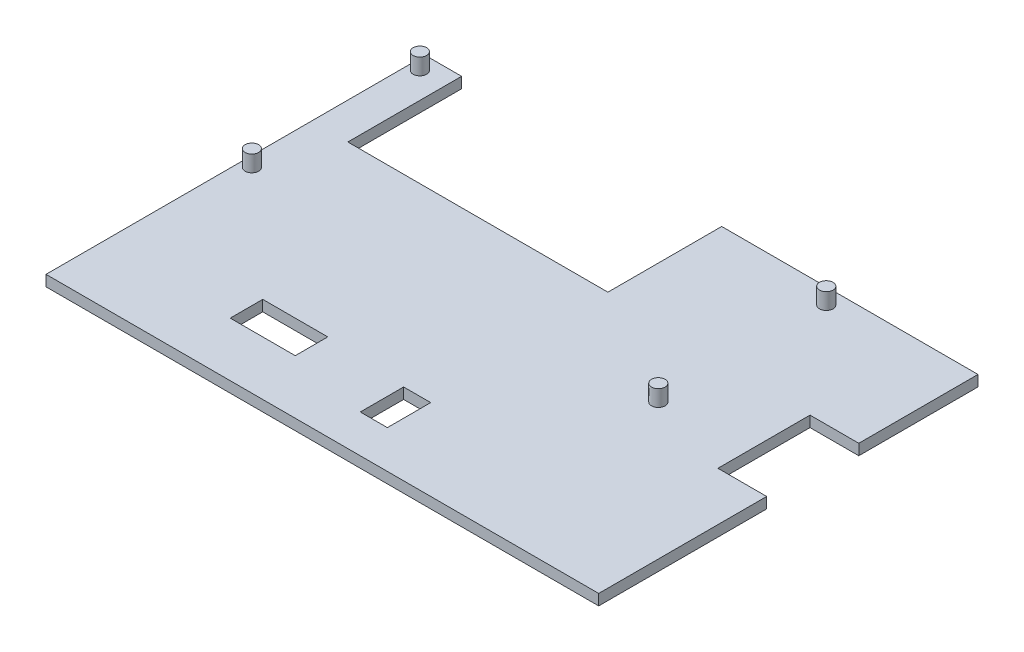
ISO-10303-21;
HEADER;
FILE_DESCRIPTION(('STEP AP214'),'2;1');
FILE_NAME('part.step','',(''),(''),'','','');
FILE_SCHEMA(('AUTOMOTIVE_DESIGN { 1 0 10303 214 1 1 1 1 }'));
ENDSEC;
DATA;
#1=APPLICATION_CONTEXT('core data for automotive mechanical design processes');
#2=APPLICATION_PROTOCOL_DEFINITION('international standard','automotive_design',2000,#1);
#3=PRODUCT_CONTEXT('',#1,'mechanical');
#4=PRODUCT('Part','Part','',(#3));
#5=PRODUCT_RELATED_PRODUCT_CATEGORY('part','',(#4));
#6=PRODUCT_DEFINITION_FORMATION('','',#4);
#7=PRODUCT_DEFINITION_CONTEXT('part definition',#1,'design');
#8=PRODUCT_DEFINITION('design','',#6,#7);
#9=PRODUCT_DEFINITION_SHAPE('','',#8);
#10=(LENGTH_UNIT() NAMED_UNIT(*) SI_UNIT(.MILLI.,.METRE.));
#11=(NAMED_UNIT(*) PLANE_ANGLE_UNIT() SI_UNIT($,.RADIAN.));
#12=(NAMED_UNIT(*) SI_UNIT($,.STERADIAN.) SOLID_ANGLE_UNIT());
#13=UNCERTAINTY_MEASURE_WITH_UNIT(LENGTH_MEASURE(1.E-05),#10,'distance_accuracy_value','');
#14=(GEOMETRIC_REPRESENTATION_CONTEXT(3) GLOBAL_UNCERTAINTY_ASSIGNED_CONTEXT((#13)) GLOBAL_UNIT_ASSIGNED_CONTEXT((#10,
#11,#12)) REPRESENTATION_CONTEXT('',''));
#15=CARTESIAN_POINT('',(0.,0.,0.));
#16=DIRECTION('',(0.,0.,1.));
#17=DIRECTION('',(1.,0.,0.));
#18=AXIS2_PLACEMENT_3D('',#15,#16,#17);
#19=CARTESIAN_POINT('',(0.,2.,0.));
#20=DIRECTION('',(0.,-1.,0.));
#21=DIRECTION('',(0.,0.,-1.));
#22=AXIS2_PLACEMENT_3D('',#19,#20,#21);
#23=PLANE('',#22);
#24=CARTESIAN_POINT('',(76.9,2.,-36.1));
#25=DIRECTION('',(0.,-1.,0.));
#26=DIRECTION('',(0.,0.,-1.));
#27=AXIS2_PLACEMENT_3D('',#24,#25,#26);
#28=CIRCLE('',#27,1.25);
#29=CARTESIAN_POINT('',(76.9,2.,-37.35));
#30=VERTEX_POINT('',#29);
#31=EDGE_CURVE('E41',#30,#30,#28,.F.);
#32=ORIENTED_EDGE('',*,*,#31,.F.);
#33=EDGE_LOOP('',(#32));
#34=FACE_BOUND('',#33,.T.);
#35=CARTESIAN_POINT('',(1.9,2.,-67.1));
#36=DIRECTION('',(0.,-1.,0.));
#37=DIRECTION('',(0.,0.,-1.));
#38=AXIS2_PLACEMENT_3D('',#35,#36,#37);
#39=CIRCLE('',#38,1.25);
#40=CARTESIAN_POINT('',(1.9,2.,-68.35));
#41=VERTEX_POINT('',#40);
#42=EDGE_CURVE('E325',#41,#41,#39,.F.);
#43=ORIENTED_EDGE('',*,*,#42,.F.);
#44=EDGE_LOOP('',(#43));
#45=FACE_BOUND('',#44,.T.);
#46=DIRECTION('',(0.,0.,1.));
#47=VECTOR('',#46,1.);
#48=CARTESIAN_POINT('',(24.,2.,-16.));
#49=LINE('',#48,#47);
#50=CARTESIAN_POINT('',(24.,2.,-16.));
#51=VERTEX_POINT('',#50);
#52=CARTESIAN_POINT('',(24.,2.,-10.));
#53=VERTEX_POINT('',#52);
#54=EDGE_CURVE('E209',#51,#53,#49,.T.);
#55=ORIENTED_EDGE('',*,*,#54,.F.);
#56=DIRECTION('',(-1.,0.,0.));
#57=VECTOR('',#56,1.);
#58=CARTESIAN_POINT('',(24.,2.,-16.));
#59=LINE('',#58,#57);
#60=CARTESIAN_POINT('',(36.,2.,-16.));
#61=VERTEX_POINT('',#60);
#62=EDGE_CURVE('E217',#61,#51,#59,.T.);
#63=ORIENTED_EDGE('',*,*,#62,.F.);
#64=DIRECTION('',(0.,0.,-1.));
#65=VECTOR('',#64,1.);
#66=CARTESIAN_POINT('',(36.,2.,-16.));
#67=LINE('',#66,#65);
#68=CARTESIAN_POINT('',(36.,2.,-10.));
#69=VERTEX_POINT('',#68);
#70=EDGE_CURVE('E214',#69,#61,#67,.T.);
#71=ORIENTED_EDGE('',*,*,#70,.F.);
#72=DIRECTION('',(1.,0.,0.));
#73=VECTOR('',#72,1.);
#74=CARTESIAN_POINT('',(24.,2.,-10.));
#75=LINE('',#74,#73);
#76=EDGE_CURVE('E211',#53,#69,#75,.T.);
#77=ORIENTED_EDGE('',*,*,#76,.F.);
#78=EDGE_LOOP('',(#55,#63,#71,#77));
#79=FACE_BOUND('',#78,.T.);
#80=DIRECTION('',(0.,0.,1.));
#81=VECTOR('',#80,1.);
#82=CARTESIAN_POINT('',(0.,2.,0.));
#83=LINE('',#82,#81);
#84=CARTESIAN_POINT('',(0.,2.,-70.));
#85=VERTEX_POINT('',#84);
#86=CARTESIAN_POINT('',(0.,2.,0.));
#87=VERTEX_POINT('',#86);
#88=EDGE_CURVE('E240',#85,#87,#83,.T.);
#89=ORIENTED_EDGE('',*,*,#88,.T.);
#90=DIRECTION('',(1.,0.,0.));
#91=VECTOR('',#90,1.);
#92=CARTESIAN_POINT('',(0.,2.,0.));
#93=LINE('',#92,#91);
#94=CARTESIAN_POINT('',(102.,2.,0.));
#95=VERTEX_POINT('',#94);
#96=EDGE_CURVE('E243',#87,#95,#93,.T.);
#97=ORIENTED_EDGE('',*,*,#96,.T.);
#98=DIRECTION('',(0.,0.,-1.));
#99=VECTOR('',#98,1.);
#100=CARTESIAN_POINT('',(102.,2.,-31.));
#101=LINE('',#100,#99);
#102=CARTESIAN_POINT('',(102.,2.,-31.));
#103=VERTEX_POINT('',#102);
#104=EDGE_CURVE('E246',#95,#103,#101,.T.);
#105=ORIENTED_EDGE('',*,*,#104,.T.);
#106=DIRECTION('',(-1.,0.,0.));
#107=VECTOR('',#106,1.);
#108=CARTESIAN_POINT('',(93.,2.,-31.));
#109=LINE('',#108,#107);
#110=CARTESIAN_POINT('',(93.,2.,-31.));
#111=VERTEX_POINT('',#110);
#112=EDGE_CURVE('E248',#103,#111,#109,.T.);
#113=ORIENTED_EDGE('',*,*,#112,.T.);
#114=DIRECTION('',(0.,0.,-1.));
#115=VECTOR('',#114,1.);
#116=CARTESIAN_POINT('',(93.,2.,-48.));
#117=LINE('',#116,#115);
#118=CARTESIAN_POINT('',(93.,2.,-48.));
#119=VERTEX_POINT('',#118);
#120=EDGE_CURVE('E250',#111,#119,#117,.T.);
#121=ORIENTED_EDGE('',*,*,#120,.T.);
#122=DIRECTION('',(1.,0.,0.));
#123=VECTOR('',#122,1.);
#124=CARTESIAN_POINT('',(102.,2.,-48.));
#125=LINE('',#124,#123);
#126=CARTESIAN_POINT('',(102.,2.,-48.));
#127=VERTEX_POINT('',#126);
#128=EDGE_CURVE('E252',#119,#127,#125,.T.);
#129=ORIENTED_EDGE('',*,*,#128,.T.);
#130=DIRECTION('',(0.,0.,-1.));
#131=VECTOR('',#130,1.);
#132=CARTESIAN_POINT('',(102.,2.,-70.));
#133=LINE('',#132,#131);
#134=CARTESIAN_POINT('',(102.,2.,-70.));
#135=VERTEX_POINT('',#134);
#136=EDGE_CURVE('E254',#127,#135,#133,.T.);
#137=ORIENTED_EDGE('',*,*,#136,.T.);
#138=DIRECTION('',(-1.,0.,0.));
#139=VECTOR('',#138,1.);
#140=CARTESIAN_POINT('',(54.7,2.,-70.));
#141=LINE('',#140,#139);
#142=CARTESIAN_POINT('',(54.7,2.,-70.));
#143=VERTEX_POINT('',#142);
#144=EDGE_CURVE('E256',#135,#143,#141,.T.);
#145=ORIENTED_EDGE('',*,*,#144,.T.);
#146=DIRECTION('',(0.,0.,1.));
#147=VECTOR('',#146,1.);
#148=CARTESIAN_POINT('',(54.7,2.,-49.));
#149=LINE('',#148,#147);
#150=CARTESIAN_POINT('',(54.7,2.,-49.));
#151=VERTEX_POINT('',#150);
#152=EDGE_CURVE('E258',#143,#151,#149,.T.);
#153=ORIENTED_EDGE('',*,*,#152,.T.);
#154=DIRECTION('',(-1.,0.,0.));
#155=VECTOR('',#154,1.);
#156=CARTESIAN_POINT('',(6.7,2.,-49.));
#157=LINE('',#156,#155);
#158=CARTESIAN_POINT('',(6.7,2.,-49.));
#159=VERTEX_POINT('',#158);
#160=EDGE_CURVE('E260',#151,#159,#157,.T.);
#161=ORIENTED_EDGE('',*,*,#160,.T.);
#162=DIRECTION('',(0.,0.,-1.));
#163=VECTOR('',#162,1.);
#164=CARTESIAN_POINT('',(6.7,2.,-70.));
#165=LINE('',#164,#163);
#166=CARTESIAN_POINT('',(6.7,2.,-70.));
#167=VERTEX_POINT('',#166);
#168=EDGE_CURVE('E262',#159,#167,#165,.T.);
#169=ORIENTED_EDGE('',*,*,#168,.T.);
#170=DIRECTION('',(-1.,0.,0.));
#171=VECTOR('',#170,1.);
#172=CARTESIAN_POINT('',(0.,2.,-70.));
#173=LINE('',#172,#171);
#174=EDGE_CURVE('E264',#167,#85,#173,.T.);
#175=ORIENTED_EDGE('',*,*,#174,.T.);
#176=EDGE_LOOP('',(#89,#97,#105,#113,#121,#129,#137,#145,#153,#161,#169,#175));
#177=FACE_BOUND('',#176,.T.);
#178=DIRECTION('',(0.,0.,1.));
#179=VECTOR('',#178,1.);
#180=CARTESIAN_POINT('',(51.,2.,-15.));
#181=LINE('',#180,#179);
#182=CARTESIAN_POINT('',(51.,2.,-15.));
#183=VERTEX_POINT('',#182);
#184=CARTESIAN_POINT('',(51.,2.,-7.));
#185=VERTEX_POINT('',#184);
#186=EDGE_CURVE('E170',#183,#185,#181,.T.);
#187=ORIENTED_EDGE('',*,*,#186,.F.);
#188=DIRECTION('',(-1.,0.,0.));
#189=VECTOR('',#188,1.);
#190=CARTESIAN_POINT('',(51.,2.,-15.));
#191=LINE('',#190,#189);
#192=CARTESIAN_POINT('',(56.,2.,-15.));
#193=VERTEX_POINT('',#192);
#194=EDGE_CURVE('E193',#193,#183,#191,.T.);
#195=ORIENTED_EDGE('',*,*,#194,.F.);
#196=DIRECTION('',(0.,0.,-1.));
#197=VECTOR('',#196,1.);
#198=CARTESIAN_POINT('',(56.,2.,-15.));
#199=LINE('',#198,#197);
#200=CARTESIAN_POINT('',(56.,2.,-7.));
#201=VERTEX_POINT('',#200);
#202=EDGE_CURVE('E191',#201,#193,#199,.T.);
#203=ORIENTED_EDGE('',*,*,#202,.F.);
#204=DIRECTION('',(1.,0.,0.));
#205=VECTOR('',#204,1.);
#206=CARTESIAN_POINT('',(51.,2.,-7.));
#207=LINE('',#206,#205);
#208=EDGE_CURVE('E178',#185,#201,#207,.T.);
#209=ORIENTED_EDGE('',*,*,#208,.F.);
#210=EDGE_LOOP('',(#187,#195,#203,#209));
#211=FACE_BOUND('',#210,.T.);
#212=CARTESIAN_POINT('',(1.9,2.,-36.1));
#213=DIRECTION('',(0.,-1.,0.));
#214=DIRECTION('',(0.,0.,-1.));
#215=AXIS2_PLACEMENT_3D('',#212,#213,#214);
#216=CIRCLE('',#215,1.25);
#217=CARTESIAN_POINT('',(1.9,2.,-37.35));
#218=VERTEX_POINT('',#217);
#219=EDGE_CURVE('E328',#218,#218,#216,.F.);
#220=ORIENTED_EDGE('',*,*,#219,.F.);
#221=EDGE_LOOP('',(#220));
#222=FACE_BOUND('',#221,.T.);
#223=CARTESIAN_POINT('',(76.9,2.,-67.1));
#224=DIRECTION('',(0.,-1.,0.));
#225=DIRECTION('',(0.,0.,-1.));
#226=AXIS2_PLACEMENT_3D('',#223,#224,#225);
#227=CIRCLE('',#226,1.25);
#228=CARTESIAN_POINT('',(76.9,2.,-68.35));
#229=VERTEX_POINT('',#228);
#230=EDGE_CURVE('E11',#229,#229,#227,.F.);
#231=ORIENTED_EDGE('',*,*,#230,.F.);
#232=EDGE_LOOP('',(#231));
#233=FACE_BOUND('',#232,.T.);
#234=ADVANCED_FACE('F33',(#34,#45,#79,#177,#211,#222,#233),#23,.F.);
#235=CARTESIAN_POINT('',(0.,0.,0.));
#236=DIRECTION('',(0.,-1.,0.));
#237=DIRECTION('',(0.,0.,-1.));
#238=AXIS2_PLACEMENT_3D('',#235,#236,#237);
#239=PLANE('',#238);
#240=DIRECTION('',(-1.,0.,0.));
#241=VECTOR('',#240,1.);
#242=CARTESIAN_POINT('',(24.,0.,-16.));
#243=LINE('',#242,#241);
#244=CARTESIAN_POINT('',(36.,0.,-16.));
#245=VERTEX_POINT('',#244);
#246=CARTESIAN_POINT('',(24.,0.,-16.));
#247=VERTEX_POINT('',#246);
#248=EDGE_CURVE('E212',#245,#247,#243,.T.);
#249=ORIENTED_EDGE('',*,*,#248,.T.);
#250=DIRECTION('',(0.,0.,1.));
#251=VECTOR('',#250,1.);
#252=CARTESIAN_POINT('',(24.,0.,-16.));
#253=LINE('',#252,#251);
#254=CARTESIAN_POINT('',(24.,0.,-10.));
#255=VERTEX_POINT('',#254);
#256=EDGE_CURVE('E186',#247,#255,#253,.T.);
#257=ORIENTED_EDGE('',*,*,#256,.T.);
#258=DIRECTION('',(1.,0.,0.));
#259=VECTOR('',#258,1.);
#260=CARTESIAN_POINT('',(24.,0.,-10.));
#261=LINE('',#260,#259);
#262=CARTESIAN_POINT('',(36.,0.,-10.));
#263=VERTEX_POINT('',#262);
#264=EDGE_CURVE('E222',#255,#263,#261,.T.);
#265=ORIENTED_EDGE('',*,*,#264,.T.);
#266=DIRECTION('',(0.,0.,-1.));
#267=VECTOR('',#266,1.);
#268=CARTESIAN_POINT('',(36.,0.,-16.));
#269=LINE('',#268,#267);
#270=EDGE_CURVE('E225',#263,#245,#269,.T.);
#271=ORIENTED_EDGE('',*,*,#270,.T.);
#272=EDGE_LOOP('',(#249,#257,#265,#271));
#273=FACE_BOUND('',#272,.T.);
#274=DIRECTION('',(0.,0.,1.));
#275=VECTOR('',#274,1.);
#276=CARTESIAN_POINT('',(0.,0.,0.));
#277=LINE('',#276,#275);
#278=CARTESIAN_POINT('',(0.,0.,-70.));
#279=VERTEX_POINT('',#278);
#280=CARTESIAN_POINT('',(0.,0.,0.));
#281=VERTEX_POINT('',#280);
#282=EDGE_CURVE('E239',#279,#281,#277,.T.);
#283=ORIENTED_EDGE('',*,*,#282,.F.);
#284=DIRECTION('',(-1.,0.,0.));
#285=VECTOR('',#284,1.);
#286=CARTESIAN_POINT('',(0.,0.,-70.));
#287=LINE('',#286,#285);
#288=CARTESIAN_POINT('',(6.7,0.,-70.));
#289=VERTEX_POINT('',#288);
#290=EDGE_CURVE('E244',#289,#279,#287,.T.);
#291=ORIENTED_EDGE('',*,*,#290,.F.);
#292=DIRECTION('',(0.,0.,-1.));
#293=VECTOR('',#292,1.);
#294=CARTESIAN_POINT('',(6.7,0.,-70.));
#295=LINE('',#294,#293);
#296=CARTESIAN_POINT('',(6.7,0.,-49.));
#297=VERTEX_POINT('',#296);
#298=EDGE_CURVE('E287',#297,#289,#295,.T.);
#299=ORIENTED_EDGE('',*,*,#298,.F.);
#300=DIRECTION('',(-1.,0.,0.));
#301=VECTOR('',#300,1.);
#302=CARTESIAN_POINT('',(6.7,0.,-49.));
#303=LINE('',#302,#301);
#304=CARTESIAN_POINT('',(54.7,0.,-49.));
#305=VERTEX_POINT('',#304);
#306=EDGE_CURVE('E285',#305,#297,#303,.T.);
#307=ORIENTED_EDGE('',*,*,#306,.F.);
#308=DIRECTION('',(0.,0.,1.));
#309=VECTOR('',#308,1.);
#310=CARTESIAN_POINT('',(54.7,0.,-49.));
#311=LINE('',#310,#309);
#312=CARTESIAN_POINT('',(54.7,0.,-70.));
#313=VERTEX_POINT('',#312);
#314=EDGE_CURVE('E283',#313,#305,#311,.T.);
#315=ORIENTED_EDGE('',*,*,#314,.F.);
#316=DIRECTION('',(-1.,0.,0.));
#317=VECTOR('',#316,1.);
#318=CARTESIAN_POINT('',(54.7,0.,-70.));
#319=LINE('',#318,#317);
#320=CARTESIAN_POINT('',(102.,0.,-70.));
#321=VERTEX_POINT('',#320);
#322=EDGE_CURVE('E281',#321,#313,#319,.T.);
#323=ORIENTED_EDGE('',*,*,#322,.F.);
#324=DIRECTION('',(0.,0.,-1.));
#325=VECTOR('',#324,1.);
#326=CARTESIAN_POINT('',(102.,0.,-70.));
#327=LINE('',#326,#325);
#328=CARTESIAN_POINT('',(102.,0.,-48.));
#329=VERTEX_POINT('',#328);
#330=EDGE_CURVE('E279',#329,#321,#327,.T.);
#331=ORIENTED_EDGE('',*,*,#330,.F.);
#332=DIRECTION('',(1.,0.,0.));
#333=VECTOR('',#332,1.);
#334=CARTESIAN_POINT('',(102.,0.,-48.));
#335=LINE('',#334,#333);
#336=CARTESIAN_POINT('',(93.,0.,-48.));
#337=VERTEX_POINT('',#336);
#338=EDGE_CURVE('E277',#337,#329,#335,.T.);
#339=ORIENTED_EDGE('',*,*,#338,.F.);
#340=DIRECTION('',(0.,0.,-1.));
#341=VECTOR('',#340,1.);
#342=CARTESIAN_POINT('',(93.,0.,-48.));
#343=LINE('',#342,#341);
#344=CARTESIAN_POINT('',(93.,0.,-31.));
#345=VERTEX_POINT('',#344);
#346=EDGE_CURVE('E275',#345,#337,#343,.T.);
#347=ORIENTED_EDGE('',*,*,#346,.F.);
#348=DIRECTION('',(-1.,0.,0.));
#349=VECTOR('',#348,1.);
#350=CARTESIAN_POINT('',(93.,0.,-31.));
#351=LINE('',#350,#349);
#352=CARTESIAN_POINT('',(102.,0.,-31.));
#353=VERTEX_POINT('',#352);
#354=EDGE_CURVE('E273',#353,#345,#351,.T.);
#355=ORIENTED_EDGE('',*,*,#354,.F.);
#356=DIRECTION('',(0.,0.,-1.));
#357=VECTOR('',#356,1.);
#358=CARTESIAN_POINT('',(102.,0.,-31.));
#359=LINE('',#358,#357);
#360=CARTESIAN_POINT('',(102.,0.,0.));
#361=VERTEX_POINT('',#360);
#362=EDGE_CURVE('E271',#361,#353,#359,.T.);
#363=ORIENTED_EDGE('',*,*,#362,.F.);
#364=DIRECTION('',(1.,0.,0.));
#365=VECTOR('',#364,1.);
#366=CARTESIAN_POINT('',(0.,0.,0.));
#367=LINE('',#366,#365);
#368=EDGE_CURVE('E269',#281,#361,#367,.T.);
#369=ORIENTED_EDGE('',*,*,#368,.F.);
#370=EDGE_LOOP('',(#283,#291,#299,#307,#315,#323,#331,#339,#347,#355,#363,#369));
#371=FACE_BOUND('',#370,.T.);
#372=DIRECTION('',(-1.,0.,0.));
#373=VECTOR('',#372,1.);
#374=CARTESIAN_POINT('',(51.,0.,-15.));
#375=LINE('',#374,#373);
#376=CARTESIAN_POINT('',(56.,0.,-15.));
#377=VERTEX_POINT('',#376);
#378=CARTESIAN_POINT('',(51.,0.,-15.));
#379=VERTEX_POINT('',#378);
#380=EDGE_CURVE('E179',#377,#379,#375,.T.);
#381=ORIENTED_EDGE('',*,*,#380,.T.);
#382=DIRECTION('',(0.,0.,1.));
#383=VECTOR('',#382,1.);
#384=CARTESIAN_POINT('',(51.,0.,-15.));
#385=LINE('',#384,#383);
#386=CARTESIAN_POINT('',(51.,0.,-7.));
#387=VERTEX_POINT('',#386);
#388=EDGE_CURVE('E56',#379,#387,#385,.T.);
#389=ORIENTED_EDGE('',*,*,#388,.T.);
#390=DIRECTION('',(1.,0.,0.));
#391=VECTOR('',#390,1.);
#392=CARTESIAN_POINT('',(51.,0.,-7.));
#393=LINE('',#392,#391);
#394=CARTESIAN_POINT('',(56.,0.,-7.));
#395=VERTEX_POINT('',#394);
#396=EDGE_CURVE('E185',#387,#395,#393,.T.);
#397=ORIENTED_EDGE('',*,*,#396,.T.);
#398=DIRECTION('',(0.,0.,-1.));
#399=VECTOR('',#398,1.);
#400=CARTESIAN_POINT('',(56.,0.,-15.));
#401=LINE('',#400,#399);
#402=EDGE_CURVE('E201',#395,#377,#401,.T.);
#403=ORIENTED_EDGE('',*,*,#402,.T.);
#404=EDGE_LOOP('',(#381,#389,#397,#403));
#405=FACE_BOUND('',#404,.T.);
#406=ADVANCED_FACE('F337',(#273,#371,#405),#239,.T.);
#407=CARTESIAN_POINT('',(0.,2.,0.));
#408=DIRECTION('',(1.,0.,0.));
#409=DIRECTION('',(0.,0.,-1.));
#410=AXIS2_PLACEMENT_3D('',#407,#408,#409);
#411=PLANE('',#410);
#412=ORIENTED_EDGE('',*,*,#282,.T.);
#413=DIRECTION('',(0.,-1.,0.));
#414=VECTOR('',#413,1.);
#415=CARTESIAN_POINT('',(0.,2.,0.));
#416=LINE('',#415,#414);
#417=EDGE_CURVE('E322',#87,#281,#416,.T.);
#418=ORIENTED_EDGE('',*,*,#417,.F.);
#419=ORIENTED_EDGE('',*,*,#88,.F.);
#420=DIRECTION('',(0.,-1.,0.));
#421=VECTOR('',#420,1.);
#422=CARTESIAN_POINT('',(0.,2.,-70.));
#423=LINE('',#422,#421);
#424=EDGE_CURVE('E266',#85,#279,#423,.T.);
#425=ORIENTED_EDGE('',*,*,#424,.T.);
#426=EDGE_LOOP('',(#412,#418,#419,#425));
#427=FACE_BOUND('',#426,.T.);
#428=ADVANCED_FACE('F35',(#427),#411,.F.);
#429=CARTESIAN_POINT('',(0.,2.,0.));
#430=DIRECTION('',(0.,0.,-1.));
#431=DIRECTION('',(-1.,0.,0.));
#432=AXIS2_PLACEMENT_3D('',#429,#430,#431);
#433=PLANE('',#432);
#434=ORIENTED_EDGE('',*,*,#368,.T.);
#435=DIRECTION('',(0.,-1.,0.));
#436=VECTOR('',#435,1.);
#437=CARTESIAN_POINT('',(102.,2.,0.));
#438=LINE('',#437,#436);
#439=EDGE_CURVE('E319',#95,#361,#438,.T.);
#440=ORIENTED_EDGE('',*,*,#439,.F.);
#441=ORIENTED_EDGE('',*,*,#96,.F.);
#442=ORIENTED_EDGE('',*,*,#417,.T.);
#443=EDGE_LOOP('',(#434,#440,#441,#442));
#444=FACE_BOUND('',#443,.T.);
#445=ADVANCED_FACE('F353',(#444),#433,.F.);
#446=CARTESIAN_POINT('',(102.,2.,-31.));
#447=DIRECTION('',(-1.,0.,0.));
#448=DIRECTION('',(0.,0.,1.));
#449=AXIS2_PLACEMENT_3D('',#446,#447,#448);
#450=PLANE('',#449);
#451=ORIENTED_EDGE('',*,*,#362,.T.);
#452=DIRECTION('',(0.,-1.,0.));
#453=VECTOR('',#452,1.);
#454=CARTESIAN_POINT('',(102.,2.,-31.));
#455=LINE('',#454,#453);
#456=EDGE_CURVE('E316',#103,#353,#455,.T.);
#457=ORIENTED_EDGE('',*,*,#456,.F.);
#458=ORIENTED_EDGE('',*,*,#104,.F.);
#459=ORIENTED_EDGE('',*,*,#439,.T.);
#460=EDGE_LOOP('',(#451,#457,#458,#459));
#461=FACE_BOUND('',#460,.T.);
#462=ADVANCED_FACE('F358',(#461),#450,.F.);
#463=CARTESIAN_POINT('',(93.,2.,-31.));
#464=DIRECTION('',(0.,0.,1.));
#465=DIRECTION('',(1.,0.,0.));
#466=AXIS2_PLACEMENT_3D('',#463,#464,#465);
#467=PLANE('',#466);
#468=ORIENTED_EDGE('',*,*,#354,.T.);
#469=DIRECTION('',(0.,-1.,0.));
#470=VECTOR('',#469,1.);
#471=CARTESIAN_POINT('',(93.,2.,-31.));
#472=LINE('',#471,#470);
#473=EDGE_CURVE('E313',#111,#345,#472,.T.);
#474=ORIENTED_EDGE('',*,*,#473,.F.);
#475=ORIENTED_EDGE('',*,*,#112,.F.);
#476=ORIENTED_EDGE('',*,*,#456,.T.);
#477=EDGE_LOOP('',(#468,#474,#475,#476));
#478=FACE_BOUND('',#477,.T.);
#479=ADVANCED_FACE('F364',(#478),#467,.F.);
#480=CARTESIAN_POINT('',(93.,2.,-48.));
#481=DIRECTION('',(-1.,0.,0.));
#482=DIRECTION('',(0.,0.,1.));
#483=AXIS2_PLACEMENT_3D('',#480,#481,#482);
#484=PLANE('',#483);
#485=ORIENTED_EDGE('',*,*,#346,.T.);
#486=DIRECTION('',(0.,-1.,0.));
#487=VECTOR('',#486,1.);
#488=CARTESIAN_POINT('',(93.,2.,-48.));
#489=LINE('',#488,#487);
#490=EDGE_CURVE('E310',#119,#337,#489,.T.);
#491=ORIENTED_EDGE('',*,*,#490,.F.);
#492=ORIENTED_EDGE('',*,*,#120,.F.);
#493=ORIENTED_EDGE('',*,*,#473,.T.);
#494=EDGE_LOOP('',(#485,#491,#492,#493));
#495=FACE_BOUND('',#494,.T.);
#496=ADVANCED_FACE('F368',(#495),#484,.F.);
#497=CARTESIAN_POINT('',(102.,2.,-48.));
#498=DIRECTION('',(0.,0.,-1.));
#499=DIRECTION('',(-1.,0.,0.));
#500=AXIS2_PLACEMENT_3D('',#497,#498,#499);
#501=PLANE('',#500);
#502=ORIENTED_EDGE('',*,*,#338,.T.);
#503=DIRECTION('',(0.,-1.,0.));
#504=VECTOR('',#503,1.);
#505=CARTESIAN_POINT('',(102.,2.,-48.));
#506=LINE('',#505,#504);
#507=EDGE_CURVE('E307',#127,#329,#506,.T.);
#508=ORIENTED_EDGE('',*,*,#507,.F.);
#509=ORIENTED_EDGE('',*,*,#128,.F.);
#510=ORIENTED_EDGE('',*,*,#490,.T.);
#511=EDGE_LOOP('',(#502,#508,#509,#510));
#512=FACE_BOUND('',#511,.T.);
#513=ADVANCED_FACE('F373',(#512),#501,.F.);
#514=CARTESIAN_POINT('',(102.,2.,-70.));
#515=DIRECTION('',(-1.,0.,0.));
#516=DIRECTION('',(0.,0.,1.));
#517=AXIS2_PLACEMENT_3D('',#514,#515,#516);
#518=PLANE('',#517);
#519=ORIENTED_EDGE('',*,*,#330,.T.);
#520=DIRECTION('',(0.,-1.,0.));
#521=VECTOR('',#520,1.);
#522=CARTESIAN_POINT('',(102.,2.,-70.));
#523=LINE('',#522,#521);
#524=EDGE_CURVE('E304',#135,#321,#523,.T.);
#525=ORIENTED_EDGE('',*,*,#524,.F.);
#526=ORIENTED_EDGE('',*,*,#136,.F.);
#527=ORIENTED_EDGE('',*,*,#507,.T.);
#528=EDGE_LOOP('',(#519,#525,#526,#527));
#529=FACE_BOUND('',#528,.T.);
#530=ADVANCED_FACE('F379',(#529),#518,.F.);
#531=CARTESIAN_POINT('',(54.7,2.,-70.));
#532=DIRECTION('',(0.,0.,1.));
#533=DIRECTION('',(1.,0.,0.));
#534=AXIS2_PLACEMENT_3D('',#531,#532,#533);
#535=PLANE('',#534);
#536=ORIENTED_EDGE('',*,*,#322,.T.);
#537=DIRECTION('',(0.,-1.,0.));
#538=VECTOR('',#537,1.);
#539=CARTESIAN_POINT('',(54.7,2.,-70.));
#540=LINE('',#539,#538);
#541=EDGE_CURVE('E301',#143,#313,#540,.T.);
#542=ORIENTED_EDGE('',*,*,#541,.F.);
#543=ORIENTED_EDGE('',*,*,#144,.F.);
#544=ORIENTED_EDGE('',*,*,#524,.T.);
#545=EDGE_LOOP('',(#536,#542,#543,#544));
#546=FACE_BOUND('',#545,.T.);
#547=ADVANCED_FACE('F383',(#546),#535,.F.);
#548=CARTESIAN_POINT('',(54.7,2.,-49.));
#549=DIRECTION('',(1.,0.,0.));
#550=DIRECTION('',(0.,0.,-1.));
#551=AXIS2_PLACEMENT_3D('',#548,#549,#550);
#552=PLANE('',#551);
#553=ORIENTED_EDGE('',*,*,#314,.T.);
#554=DIRECTION('',(0.,-1.,0.));
#555=VECTOR('',#554,1.);
#556=CARTESIAN_POINT('',(54.7,2.,-49.));
#557=LINE('',#556,#555);
#558=EDGE_CURVE('E298',#151,#305,#557,.T.);
#559=ORIENTED_EDGE('',*,*,#558,.F.);
#560=ORIENTED_EDGE('',*,*,#152,.F.);
#561=ORIENTED_EDGE('',*,*,#541,.T.);
#562=EDGE_LOOP('',(#553,#559,#560,#561));
#563=FACE_BOUND('',#562,.T.);
#564=ADVANCED_FACE('F388',(#563),#552,.F.);
#565=CARTESIAN_POINT('',(6.7,2.,-49.));
#566=DIRECTION('',(0.,0.,1.));
#567=DIRECTION('',(1.,0.,0.));
#568=AXIS2_PLACEMENT_3D('',#565,#566,#567);
#569=PLANE('',#568);
#570=ORIENTED_EDGE('',*,*,#306,.T.);
#571=DIRECTION('',(0.,-1.,0.));
#572=VECTOR('',#571,1.);
#573=CARTESIAN_POINT('',(6.7,2.,-49.));
#574=LINE('',#573,#572);
#575=EDGE_CURVE('E295',#159,#297,#574,.T.);
#576=ORIENTED_EDGE('',*,*,#575,.F.);
#577=ORIENTED_EDGE('',*,*,#160,.F.);
#578=ORIENTED_EDGE('',*,*,#558,.T.);
#579=EDGE_LOOP('',(#570,#576,#577,#578));
#580=FACE_BOUND('',#579,.T.);
#581=ADVANCED_FACE('F394',(#580),#569,.F.);
#582=CARTESIAN_POINT('',(6.7,2.,-70.));
#583=DIRECTION('',(-1.,0.,0.));
#584=DIRECTION('',(0.,0.,1.));
#585=AXIS2_PLACEMENT_3D('',#582,#583,#584);
#586=PLANE('',#585);
#587=ORIENTED_EDGE('',*,*,#298,.T.);
#588=DIRECTION('',(0.,-1.,0.));
#589=VECTOR('',#588,1.);
#590=CARTESIAN_POINT('',(6.7,2.,-70.));
#591=LINE('',#590,#589);
#592=EDGE_CURVE('E292',#167,#289,#591,.T.);
#593=ORIENTED_EDGE('',*,*,#592,.F.);
#594=ORIENTED_EDGE('',*,*,#168,.F.);
#595=ORIENTED_EDGE('',*,*,#575,.T.);
#596=EDGE_LOOP('',(#587,#593,#594,#595));
#597=FACE_BOUND('',#596,.T.);
#598=ADVANCED_FACE('F398',(#597),#586,.F.);
#599=CARTESIAN_POINT('',(0.,2.,-70.));
#600=DIRECTION('',(0.,0.,1.));
#601=DIRECTION('',(1.,0.,0.));
#602=AXIS2_PLACEMENT_3D('',#599,#600,#601);
#603=PLANE('',#602);
#604=ORIENTED_EDGE('',*,*,#290,.T.);
#605=ORIENTED_EDGE('',*,*,#424,.F.);
#606=ORIENTED_EDGE('',*,*,#174,.F.);
#607=ORIENTED_EDGE('',*,*,#592,.T.);
#608=EDGE_LOOP('',(#604,#605,#606,#607));
#609=FACE_BOUND('',#608,.T.);
#610=ADVANCED_FACE('F401',(#609),#603,.F.);
#611=CARTESIAN_POINT('',(24.,2.,-16.));
#612=DIRECTION('',(1.,0.,0.));
#613=DIRECTION('',(0.,0.,-1.));
#614=AXIS2_PLACEMENT_3D('',#611,#612,#613);
#615=PLANE('',#614);
#616=ORIENTED_EDGE('',*,*,#256,.F.);
#617=DIRECTION('',(0.,-1.,0.));
#618=VECTOR('',#617,1.);
#619=CARTESIAN_POINT('',(24.,2.,-16.));
#620=LINE('',#619,#618);
#621=EDGE_CURVE('E219',#51,#247,#620,.T.);
#622=ORIENTED_EDGE('',*,*,#621,.F.);
#623=ORIENTED_EDGE('',*,*,#54,.T.);
#624=DIRECTION('',(0.,-1.,0.));
#625=VECTOR('',#624,1.);
#626=CARTESIAN_POINT('',(24.,2.,-10.));
#627=LINE('',#626,#625);
#628=EDGE_CURVE('E236',#53,#255,#627,.T.);
#629=ORIENTED_EDGE('',*,*,#628,.T.);
#630=EDGE_LOOP('',(#616,#622,#623,#629));
#631=FACE_BOUND('',#630,.T.);
#632=ADVANCED_FACE('F439',(#631),#615,.T.);
#633=CARTESIAN_POINT('',(24.,2.,-10.));
#634=DIRECTION('',(0.,0.,-1.));
#635=DIRECTION('',(-1.,0.,0.));
#636=AXIS2_PLACEMENT_3D('',#633,#634,#635);
#637=PLANE('',#636);
#638=ORIENTED_EDGE('',*,*,#264,.F.);
#639=ORIENTED_EDGE('',*,*,#628,.F.);
#640=ORIENTED_EDGE('',*,*,#76,.T.);
#641=DIRECTION('',(0.,-1.,0.));
#642=VECTOR('',#641,1.);
#643=CARTESIAN_POINT('',(36.,2.,-10.));
#644=LINE('',#643,#642);
#645=EDGE_CURVE('E234',#69,#263,#644,.T.);
#646=ORIENTED_EDGE('',*,*,#645,.T.);
#647=EDGE_LOOP('',(#638,#639,#640,#646));
#648=FACE_BOUND('',#647,.T.);
#649=ADVANCED_FACE('F435',(#648),#637,.T.);
#650=CARTESIAN_POINT('',(36.,2.,-16.));
#651=DIRECTION('',(-1.,0.,0.));
#652=DIRECTION('',(0.,0.,1.));
#653=AXIS2_PLACEMENT_3D('',#650,#651,#652);
#654=PLANE('',#653);
#655=ORIENTED_EDGE('',*,*,#270,.F.);
#656=ORIENTED_EDGE('',*,*,#645,.F.);
#657=ORIENTED_EDGE('',*,*,#70,.T.);
#658=DIRECTION('',(0.,-1.,0.));
#659=VECTOR('',#658,1.);
#660=CARTESIAN_POINT('',(36.,2.,-16.));
#661=LINE('',#660,#659);
#662=EDGE_CURVE('E232',#61,#245,#661,.T.);
#663=ORIENTED_EDGE('',*,*,#662,.T.);
#664=EDGE_LOOP('',(#655,#656,#657,#663));
#665=FACE_BOUND('',#664,.T.);
#666=ADVANCED_FACE('F431',(#665),#654,.T.);
#667=CARTESIAN_POINT('',(24.,2.,-16.));
#668=DIRECTION('',(0.,0.,1.));
#669=DIRECTION('',(1.,0.,0.));
#670=AXIS2_PLACEMENT_3D('',#667,#668,#669);
#671=PLANE('',#670);
#672=ORIENTED_EDGE('',*,*,#248,.F.);
#673=ORIENTED_EDGE('',*,*,#662,.F.);
#674=ORIENTED_EDGE('',*,*,#62,.T.);
#675=ORIENTED_EDGE('',*,*,#621,.T.);
#676=EDGE_LOOP('',(#672,#673,#674,#675));
#677=FACE_BOUND('',#676,.T.);
#678=ADVANCED_FACE('F428',(#677),#671,.T.);
#679=CARTESIAN_POINT('',(51.,2.,-15.));
#680=DIRECTION('',(1.,0.,0.));
#681=DIRECTION('',(0.,0.,-1.));
#682=AXIS2_PLACEMENT_3D('',#679,#680,#681);
#683=PLANE('',#682);
#684=ORIENTED_EDGE('',*,*,#388,.F.);
#685=DIRECTION('',(0.,-1.,0.));
#686=VECTOR('',#685,1.);
#687=CARTESIAN_POINT('',(51.,2.,-15.));
#688=LINE('',#687,#686);
#689=EDGE_CURVE('E174',#183,#379,#688,.T.);
#690=ORIENTED_EDGE('',*,*,#689,.F.);
#691=ORIENTED_EDGE('',*,*,#186,.T.);
#692=DIRECTION('',(0.,-1.,0.));
#693=VECTOR('',#692,1.);
#694=CARTESIAN_POINT('',(51.,2.,-7.));
#695=LINE('',#694,#693);
#696=EDGE_CURVE('E173',#185,#387,#695,.T.);
#697=ORIENTED_EDGE('',*,*,#696,.T.);
#698=EDGE_LOOP('',(#684,#690,#691,#697));
#699=FACE_BOUND('',#698,.T.);
#700=ADVANCED_FACE('F172',(#699),#683,.T.);
#701=CARTESIAN_POINT('',(51.,2.,-7.));
#702=DIRECTION('',(0.,0.,-1.));
#703=DIRECTION('',(-1.,0.,0.));
#704=AXIS2_PLACEMENT_3D('',#701,#702,#703);
#705=PLANE('',#704);
#706=ORIENTED_EDGE('',*,*,#396,.F.);
#707=ORIENTED_EDGE('',*,*,#696,.F.);
#708=ORIENTED_EDGE('',*,*,#208,.T.);
#709=DIRECTION('',(0.,-1.,0.));
#710=VECTOR('',#709,1.);
#711=CARTESIAN_POINT('',(56.,2.,-7.));
#712=LINE('',#711,#710);
#713=EDGE_CURVE('E187',#201,#395,#712,.T.);
#714=ORIENTED_EDGE('',*,*,#713,.T.);
#715=EDGE_LOOP('',(#706,#707,#708,#714));
#716=FACE_BOUND('',#715,.T.);
#717=ADVANCED_FACE('F182',(#716),#705,.T.);
#718=CARTESIAN_POINT('',(56.,2.,-15.));
#719=DIRECTION('',(-1.,0.,0.));
#720=DIRECTION('',(0.,0.,1.));
#721=AXIS2_PLACEMENT_3D('',#718,#719,#720);
#722=PLANE('',#721);
#723=ORIENTED_EDGE('',*,*,#402,.F.);
#724=ORIENTED_EDGE('',*,*,#713,.F.);
#725=ORIENTED_EDGE('',*,*,#202,.T.);
#726=DIRECTION('',(0.,-1.,0.));
#727=VECTOR('',#726,1.);
#728=CARTESIAN_POINT('',(56.,2.,-15.));
#729=LINE('',#728,#727);
#730=EDGE_CURVE('E48',#193,#377,#729,.T.);
#731=ORIENTED_EDGE('',*,*,#730,.T.);
#732=EDGE_LOOP('',(#723,#724,#725,#731));
#733=FACE_BOUND('',#732,.T.);
#734=ADVANCED_FACE('F411',(#733),#722,.T.);
#735=CARTESIAN_POINT('',(51.,2.,-15.));
#736=DIRECTION('',(0.,0.,1.));
#737=DIRECTION('',(1.,0.,0.));
#738=AXIS2_PLACEMENT_3D('',#735,#736,#737);
#739=PLANE('',#738);
#740=ORIENTED_EDGE('',*,*,#380,.F.);
#741=ORIENTED_EDGE('',*,*,#730,.F.);
#742=ORIENTED_EDGE('',*,*,#194,.T.);
#743=ORIENTED_EDGE('',*,*,#689,.T.);
#744=EDGE_LOOP('',(#740,#741,#742,#743));
#745=FACE_BOUND('',#744,.T.);
#746=ADVANCED_FACE('F408',(#745),#739,.T.);
#747=CARTESIAN_POINT('',(1.9,5.,-67.1));
#748=DIRECTION('',(0.,-1.,0.));
#749=DIRECTION('',(0.,0.,-1.));
#750=AXIS2_PLACEMENT_3D('',#747,#748,#749);
#751=CYLINDRICAL_SURFACE('',#750,1.25);
#752=CARTESIAN_POINT('',(1.9,5.,-67.1));
#753=DIRECTION('',(0.,1.,0.));
#754=DIRECTION('',(0.,0.,1.));
#755=AXIS2_PLACEMENT_3D('',#752,#753,#754);
#756=CIRCLE('',#755,1.25);
#757=CARTESIAN_POINT('',(1.9,5.,-65.85));
#758=VERTEX_POINT('',#757);
#759=EDGE_CURVE('E199',#758,#758,#756,.T.);
#760=ORIENTED_EDGE('',*,*,#759,.F.);
#761=EDGE_LOOP('',(#760));
#762=FACE_BOUND('',#761,.T.);
#763=ORIENTED_EDGE('',*,*,#42,.T.);
#764=EDGE_LOOP('',(#763));
#765=FACE_BOUND('',#764,.T.);
#766=ADVANCED_FACE('F410',(#762,#765),#751,.T.);
#767=CARTESIAN_POINT('',(1.9,5.,-67.1));
#768=DIRECTION('',(0.,1.,0.));
#769=DIRECTION('',(0.,0.,1.));
#770=AXIS2_PLACEMENT_3D('',#767,#768,#769);
#771=PLANE('',#770);
#772=ORIENTED_EDGE('',*,*,#759,.T.);
#773=EDGE_LOOP('',(#772));
#774=FACE_BOUND('',#773,.T.);
#775=ADVANCED_FACE('F417',(#774),#771,.T.);
#776=CARTESIAN_POINT('',(1.9,5.,-36.1));
#777=DIRECTION('',(0.,-1.,0.));
#778=DIRECTION('',(0.,0.,-1.));
#779=AXIS2_PLACEMENT_3D('',#776,#777,#778);
#780=CYLINDRICAL_SURFACE('',#779,1.25);
#781=CARTESIAN_POINT('',(1.9,5.,-36.1));
#782=DIRECTION('',(0.,1.,0.));
#783=DIRECTION('',(0.,0.,1.));
#784=AXIS2_PLACEMENT_3D('',#781,#782,#783);
#785=CIRCLE('',#784,1.25);
#786=CARTESIAN_POINT('',(1.9,5.,-34.85));
#787=VERTEX_POINT('',#786);
#788=EDGE_CURVE('E563',#787,#787,#785,.T.);
#789=ORIENTED_EDGE('',*,*,#788,.F.);
#790=EDGE_LOOP('',(#789));
#791=FACE_BOUND('',#790,.T.);
#792=ORIENTED_EDGE('',*,*,#219,.T.);
#793=EDGE_LOOP('',(#792));
#794=FACE_BOUND('',#793,.T.);
#795=ADVANCED_FACE('F495',(#791,#794),#780,.T.);
#796=CARTESIAN_POINT('',(1.9,5.,-36.1));
#797=DIRECTION('',(0.,1.,0.));
#798=DIRECTION('',(0.,0.,1.));
#799=AXIS2_PLACEMENT_3D('',#796,#797,#798);
#800=PLANE('',#799);
#801=ORIENTED_EDGE('',*,*,#788,.T.);
#802=EDGE_LOOP('',(#801));
#803=FACE_BOUND('',#802,.T.);
#804=ADVANCED_FACE('F504',(#803),#800,.T.);
#805=CARTESIAN_POINT('',(76.9,5.,-36.1));
#806=DIRECTION('',(0.,-1.,0.));
#807=DIRECTION('',(0.,0.,-1.));
#808=AXIS2_PLACEMENT_3D('',#805,#806,#807);
#809=CYLINDRICAL_SURFACE('',#808,1.25);
#810=CARTESIAN_POINT('',(76.9,5.,-36.1));
#811=DIRECTION('',(0.,1.,0.));
#812=DIRECTION('',(0.,0.,1.));
#813=AXIS2_PLACEMENT_3D('',#810,#811,#812);
#814=CIRCLE('',#813,1.25);
#815=CARTESIAN_POINT('',(76.9,5.,-34.85));
#816=VERTEX_POINT('',#815);
#817=EDGE_CURVE('E560',#816,#816,#814,.T.);
#818=ORIENTED_EDGE('',*,*,#817,.F.);
#819=EDGE_LOOP('',(#818));
#820=FACE_BOUND('',#819,.T.);
#821=ORIENTED_EDGE('',*,*,#31,.T.);
#822=EDGE_LOOP('',(#821));
#823=FACE_BOUND('',#822,.T.);
#824=ADVANCED_FACE('F333',(#820,#823),#809,.T.);
#825=CARTESIAN_POINT('',(76.9,5.,-36.1));
#826=DIRECTION('',(0.,1.,0.));
#827=DIRECTION('',(0.,0.,1.));
#828=AXIS2_PLACEMENT_3D('',#825,#826,#827);
#829=PLANE('',#828);
#830=ORIENTED_EDGE('',*,*,#817,.T.);
#831=EDGE_LOOP('',(#830));
#832=FACE_BOUND('',#831,.T.);
#833=ADVANCED_FACE('F523',(#832),#829,.T.);
#834=CARTESIAN_POINT('',(76.9,5.,-67.1));
#835=DIRECTION('',(0.,-1.,0.));
#836=DIRECTION('',(0.,0.,-1.));
#837=AXIS2_PLACEMENT_3D('',#834,#835,#836);
#838=CYLINDRICAL_SURFACE('',#837,1.25);
#839=CARTESIAN_POINT('',(76.9,5.,-67.1));
#840=DIRECTION('',(0.,1.,0.));
#841=DIRECTION('',(0.,0.,1.));
#842=AXIS2_PLACEMENT_3D('',#839,#840,#841);
#843=CIRCLE('',#842,1.25);
#844=CARTESIAN_POINT('',(76.9,5.,-65.85));
#845=VERTEX_POINT('',#844);
#846=EDGE_CURVE('E559',#845,#845,#843,.T.);
#847=ORIENTED_EDGE('',*,*,#846,.F.);
#848=EDGE_LOOP('',(#847));
#849=FACE_BOUND('',#848,.T.);
#850=ORIENTED_EDGE('',*,*,#230,.T.);
#851=EDGE_LOOP('',(#850));
#852=FACE_BOUND('',#851,.T.);
#853=ADVANCED_FACE('F533',(#849,#852),#838,.T.);
#854=CARTESIAN_POINT('',(76.9,5.,-67.1));
#855=DIRECTION('',(0.,1.,0.));
#856=DIRECTION('',(0.,0.,1.));
#857=AXIS2_PLACEMENT_3D('',#854,#855,#856);
#858=PLANE('',#857);
#859=ORIENTED_EDGE('',*,*,#846,.T.);
#860=EDGE_LOOP('',(#859));
#861=FACE_BOUND('',#860,.T.);
#862=ADVANCED_FACE('F543',(#861),#858,.T.);
#863=CLOSED_SHELL('',(#234,#406,#428,#445,#462,#479,#496,#513,#530,#547,#564,#581,#598,#610,
#632,#649,#666,#678,#700,#717,#734,#746,#766,#775,#795,#804,#824,#833,#853,#862));
#864=MANIFOLD_SOLID_BREP('B2',#863);
#865=ADVANCED_BREP_SHAPE_REPRESENTATION('',(#18,#864),#14);
#866=SHAPE_DEFINITION_REPRESENTATION(#9,#865);
ENDSEC;
END-ISO-10303-21;
